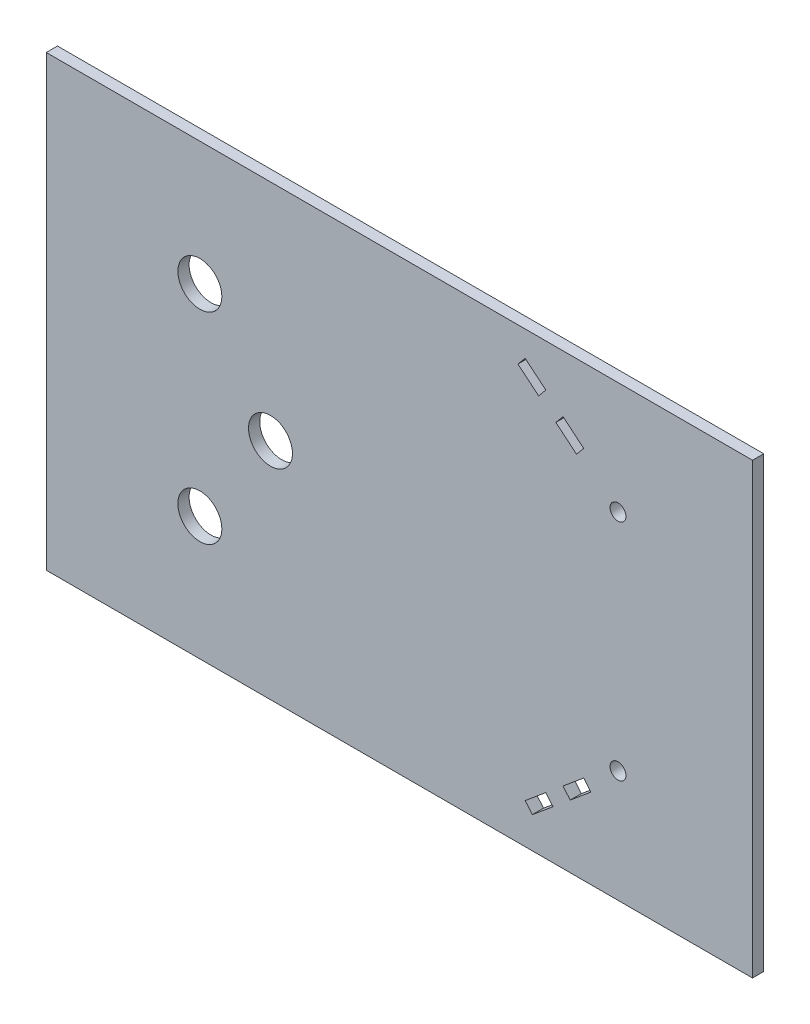
ISO-10303-21;
HEADER;
FILE_DESCRIPTION(('STEP AP214'),'2;1');
FILE_NAME('part.step','',(''),(''),'','','');
FILE_SCHEMA(('AUTOMOTIVE_DESIGN { 1 0 10303 214 1 1 1 1 }'));
ENDSEC;
DATA;
#1=APPLICATION_CONTEXT('core data for automotive mechanical design processes');
#2=APPLICATION_PROTOCOL_DEFINITION('international standard','automotive_design',2000,#1);
#3=PRODUCT_CONTEXT('',#1,'mechanical');
#4=PRODUCT('Part','Part','',(#3));
#5=PRODUCT_RELATED_PRODUCT_CATEGORY('part','',(#4));
#6=PRODUCT_DEFINITION_FORMATION('','',#4);
#7=PRODUCT_DEFINITION_CONTEXT('part definition',#1,'design');
#8=PRODUCT_DEFINITION('design','',#6,#7);
#9=PRODUCT_DEFINITION_SHAPE('','',#8);
#10=(LENGTH_UNIT() NAMED_UNIT(*) SI_UNIT(.MILLI.,.METRE.));
#11=(NAMED_UNIT(*) PLANE_ANGLE_UNIT() SI_UNIT($,.RADIAN.));
#12=(NAMED_UNIT(*) SI_UNIT($,.STERADIAN.) SOLID_ANGLE_UNIT());
#13=UNCERTAINTY_MEASURE_WITH_UNIT(LENGTH_MEASURE(1.E-05),#10,'distance_accuracy_value','');
#14=(GEOMETRIC_REPRESENTATION_CONTEXT(3) GLOBAL_UNCERTAINTY_ASSIGNED_CONTEXT((#13)) GLOBAL_UNIT_ASSIGNED_CONTEXT((#10,
#11,#12)) REPRESENTATION_CONTEXT('',''));
#15=CARTESIAN_POINT('',(0.,0.,0.));
#16=DIRECTION('',(0.,0.,1.));
#17=DIRECTION('',(1.,0.,0.));
#18=AXIS2_PLACEMENT_3D('',#15,#16,#17);
#19=CARTESIAN_POINT('',(0.,0.,6.35));
#20=DIRECTION('',(1.,0.,0.));
#21=DIRECTION('',(0.,0.,-1.));
#22=AXIS2_PLACEMENT_3D('',#19,#20,#21);
#23=PLANE('',#22);
#24=DIRECTION('',(0.,-1.,0.));
#25=VECTOR('',#24,1.);
#26=CARTESIAN_POINT('',(0.,0.,0.));
#27=LINE('',#26,#25);
#28=CARTESIAN_POINT('',(0.,254.,0.));
#29=VERTEX_POINT('',#28);
#30=CARTESIAN_POINT('',(0.,0.,0.));
#31=VERTEX_POINT('',#30);
#32=EDGE_CURVE('E396',#29,#31,#27,.T.);
#33=ORIENTED_EDGE('',*,*,#32,.T.);
#34=DIRECTION('',(0.,0.,-1.));
#35=VECTOR('',#34,1.);
#36=CARTESIAN_POINT('',(0.,0.,6.35));
#37=LINE('',#36,#35);
#38=CARTESIAN_POINT('',(0.,0.,6.35));
#39=VERTEX_POINT('',#38);
#40=EDGE_CURVE('E11',#39,#31,#37,.T.);
#41=ORIENTED_EDGE('',*,*,#40,.F.);
#42=DIRECTION('',(0.,-1.,0.));
#43=VECTOR('',#42,1.);
#44=CARTESIAN_POINT('',(0.,0.,6.35));
#45=LINE('',#44,#43);
#46=CARTESIAN_POINT('',(0.,254.,6.35));
#47=VERTEX_POINT('',#46);
#48=EDGE_CURVE('E400',#47,#39,#45,.T.);
#49=ORIENTED_EDGE('',*,*,#48,.F.);
#50=DIRECTION('',(0.,0.,-1.));
#51=VECTOR('',#50,1.);
#52=CARTESIAN_POINT('',(0.,254.,6.35));
#53=LINE('',#52,#51);
#54=EDGE_CURVE('E414',#47,#29,#53,.T.);
#55=ORIENTED_EDGE('',*,*,#54,.T.);
#56=EDGE_LOOP('',(#33,#41,#49,#55));
#57=FACE_BOUND('',#56,.T.);
#58=ADVANCED_FACE('F39',(#57),#23,.F.);
#59=CARTESIAN_POINT('',(0.,0.,6.35));
#60=DIRECTION('',(0.,1.,0.));
#61=DIRECTION('',(0.,0.,1.));
#62=AXIS2_PLACEMENT_3D('',#59,#60,#61);
#63=PLANE('',#62);
#64=DIRECTION('',(1.,0.,0.));
#65=VECTOR('',#64,1.);
#66=CARTESIAN_POINT('',(0.,0.,0.));
#67=LINE('',#66,#65);
#68=CARTESIAN_POINT('',(400.05,0.,0.));
#69=VERTEX_POINT('',#68);
#70=EDGE_CURVE('E418',#31,#69,#67,.T.);
#71=ORIENTED_EDGE('',*,*,#70,.T.);
#72=DIRECTION('',(0.,0.,-1.));
#73=VECTOR('',#72,1.);
#74=CARTESIAN_POINT('',(400.05,0.,6.35));
#75=LINE('',#74,#73);
#76=CARTESIAN_POINT('',(400.05,0.,6.35));
#77=VERTEX_POINT('',#76);
#78=EDGE_CURVE('E47',#77,#69,#75,.T.);
#79=ORIENTED_EDGE('',*,*,#78,.F.);
#80=DIRECTION('',(1.,0.,0.));
#81=VECTOR('',#80,1.);
#82=CARTESIAN_POINT('',(0.,0.,6.35));
#83=LINE('',#82,#81);
#84=EDGE_CURVE('E404',#39,#77,#83,.T.);
#85=ORIENTED_EDGE('',*,*,#84,.F.);
#86=ORIENTED_EDGE('',*,*,#40,.T.);
#87=EDGE_LOOP('',(#71,#79,#85,#86));
#88=FACE_BOUND('',#87,.T.);
#89=ADVANCED_FACE('F453',(#88),#63,.F.);
#90=CARTESIAN_POINT('',(400.05,0.,6.35));
#91=DIRECTION('',(-1.,0.,0.));
#92=DIRECTION('',(0.,0.,1.));
#93=AXIS2_PLACEMENT_3D('',#90,#91,#92);
#94=PLANE('',#93);
#95=DIRECTION('',(0.,1.,0.));
#96=VECTOR('',#95,1.);
#97=CARTESIAN_POINT('',(400.05,0.,0.));
#98=LINE('',#97,#96);
#99=CARTESIAN_POINT('',(400.05,254.,0.));
#100=VERTEX_POINT('',#99);
#101=EDGE_CURVE('E421',#69,#100,#98,.T.);
#102=ORIENTED_EDGE('',*,*,#101,.T.);
#103=DIRECTION('',(0.,0.,-1.));
#104=VECTOR('',#103,1.);
#105=CARTESIAN_POINT('',(400.05,254.,6.35));
#106=LINE('',#105,#104);
#107=CARTESIAN_POINT('',(400.05,254.,6.35));
#108=VERTEX_POINT('',#107);
#109=EDGE_CURVE('E429',#108,#100,#106,.T.);
#110=ORIENTED_EDGE('',*,*,#109,.F.);
#111=DIRECTION('',(0.,1.,0.));
#112=VECTOR('',#111,1.);
#113=CARTESIAN_POINT('',(400.05,0.,6.35));
#114=LINE('',#113,#112);
#115=EDGE_CURVE('E408',#77,#108,#114,.T.);
#116=ORIENTED_EDGE('',*,*,#115,.F.);
#117=ORIENTED_EDGE('',*,*,#78,.T.);
#118=EDGE_LOOP('',(#102,#110,#116,#117));
#119=FACE_BOUND('',#118,.T.);
#120=ADVANCED_FACE('F438',(#119),#94,.F.);
#121=CARTESIAN_POINT('',(0.,254.,6.35));
#122=DIRECTION('',(0.,-1.,0.));
#123=DIRECTION('',(0.,0.,-1.));
#124=AXIS2_PLACEMENT_3D('',#121,#122,#123);
#125=PLANE('',#124);
#126=DIRECTION('',(-1.,0.,0.));
#127=VECTOR('',#126,1.);
#128=CARTESIAN_POINT('',(0.,254.,0.));
#129=LINE('',#128,#127);
#130=EDGE_CURVE('E405',#100,#29,#129,.T.);
#131=ORIENTED_EDGE('',*,*,#130,.T.);
#132=ORIENTED_EDGE('',*,*,#54,.F.);
#133=DIRECTION('',(-1.,0.,0.));
#134=VECTOR('',#133,1.);
#135=CARTESIAN_POINT('',(0.,254.,6.35));
#136=LINE('',#135,#134);
#137=EDGE_CURVE('E411',#108,#47,#136,.T.);
#138=ORIENTED_EDGE('',*,*,#137,.F.);
#139=ORIENTED_EDGE('',*,*,#109,.T.);
#140=EDGE_LOOP('',(#131,#132,#138,#139));
#141=FACE_BOUND('',#140,.T.);
#142=ADVANCED_FACE('F446',(#141),#125,.F.);
#143=CARTESIAN_POINT('',(0.,0.,6.35));
#144=DIRECTION('',(0.,0.,-1.));
#145=DIRECTION('',(-1.,0.,0.));
#146=AXIS2_PLACEMENT_3D('',#143,#144,#145);
#147=PLANE('',#146);
#148=DIRECTION('',(-0.768221279597376,-0.64018439966448,0.));
#149=VECTOR('',#148,1.);
#150=CARTESIAN_POINT('',(271.25497425998,22.644992790318,6.35));
#151=LINE('',#150,#149);
#152=CARTESIAN_POINT('',(282.962666561044,32.4014030412046,6.35));
#153=VERTEX_POINT('',#152);
#154=CARTESIAN_POINT('',(271.25497425998,22.644992790318,6.35));
#155=VERTEX_POINT('',#154);
#156=EDGE_CURVE('E355',#153,#155,#151,.T.);
#157=ORIENTED_EDGE('',*,*,#156,.F.);
#158=DIRECTION('',(-0.64018439966448,0.768221279597376,0.));
#159=VECTOR('',#158,1.);
#160=CARTESIAN_POINT('',(287.027837498914,27.5231979157613,6.35));
#161=LINE('',#160,#159);
#162=CARTESIAN_POINT('',(287.027837498914,27.5231979157613,6.35));
#163=VERTEX_POINT('',#162);
#164=EDGE_CURVE('E54',#163,#153,#161,.T.);
#165=ORIENTED_EDGE('',*,*,#164,.F.);
#166=DIRECTION('',(0.768221279597376,0.640184399664479,0.));
#167=VECTOR('',#166,1.);
#168=CARTESIAN_POINT('',(275.32014519785,17.7667876648747,6.35));
#169=LINE('',#168,#167);
#170=CARTESIAN_POINT('',(275.32014519785,17.7667876648747,6.35));
#171=VERTEX_POINT('',#170);
#172=EDGE_CURVE('E340',#171,#163,#169,.T.);
#173=ORIENTED_EDGE('',*,*,#172,.F.);
#174=DIRECTION('',(0.64018439966448,-0.768221279597376,0.));
#175=VECTOR('',#174,1.);
#176=CARTESIAN_POINT('',(275.32014519785,17.7667876648747,6.35));
#177=LINE('',#176,#175);
#178=EDGE_CURVE('E359',#155,#171,#177,.T.);
#179=ORIENTED_EDGE('',*,*,#178,.F.);
#180=EDGE_LOOP('',(#157,#165,#173,#179));
#181=FACE_BOUND('',#180,.T.);
#182=DIRECTION('',(0.768221279597375,-0.640184399664481,0.));
#183=VECTOR('',#182,1.);
#184=CARTESIAN_POINT('',(267.189803322111,234.742649657906,6.35));
#185=LINE('',#184,#183);
#186=CARTESIAN_POINT('',(267.189803322111,234.742649657906,6.35));
#187=VERTEX_POINT('',#186);
#188=CARTESIAN_POINT('',(278.897495623175,224.98623940702,6.35));
#189=VERTEX_POINT('',#188);
#190=EDGE_CURVE('E311',#187,#189,#185,.T.);
#191=ORIENTED_EDGE('',*,*,#190,.F.);
#192=DIRECTION('',(-0.64018439966448,-0.768221279597376,0.));
#193=VECTOR('',#192,1.);
#194=CARTESIAN_POINT('',(271.25497425998,239.62085478335,6.35));
#195=LINE('',#194,#193);
#196=CARTESIAN_POINT('',(271.25497425998,239.62085478335,6.35));
#197=VERTEX_POINT('',#196);
#198=EDGE_CURVE('E62',#197,#187,#195,.T.);
#199=ORIENTED_EDGE('',*,*,#198,.F.);
#200=DIRECTION('',(-0.768221279597375,0.640184399664481,0.));
#201=VECTOR('',#200,1.);
#202=CARTESIAN_POINT('',(271.25497425998,239.62085478335,6.35));
#203=LINE('',#202,#201);
#204=CARTESIAN_POINT('',(282.962666561044,229.864444532463,6.35));
#205=VERTEX_POINT('',#204);
#206=EDGE_CURVE('E296',#205,#197,#203,.T.);
#207=ORIENTED_EDGE('',*,*,#206,.F.);
#208=DIRECTION('',(0.64018439966448,0.768221279597376,0.));
#209=VECTOR('',#208,1.);
#210=CARTESIAN_POINT('',(282.962666561044,229.864444532463,6.35));
#211=LINE('',#210,#209);
#212=EDGE_CURVE('E316',#189,#205,#211,.T.);
#213=ORIENTED_EDGE('',*,*,#212,.F.);
#214=EDGE_LOOP('',(#191,#199,#207,#213));
#215=FACE_BOUND('',#214,.T.);
#216=CARTESIAN_POINT('',(127.,127.,6.35));
#217=DIRECTION('',(0.,0.,1.));
#218=DIRECTION('',(1.,0.,0.));
#219=AXIS2_PLACEMENT_3D('',#216,#217,#218);
#220=CIRCLE('',#219,12.446);
#221=CARTESIAN_POINT('',(139.446,127.,6.35));
#222=VERTEX_POINT('',#221);
#223=EDGE_CURVE('E326',#222,#222,#220,.T.);
#224=ORIENTED_EDGE('',*,*,#223,.F.);
#225=EDGE_LOOP('',(#224));
#226=FACE_BOUND('',#225,.T.);
#227=CARTESIAN_POINT('',(323.85,190.5,6.35));
#228=DIRECTION('',(0.,0.,1.));
#229=DIRECTION('',(1.,0.,0.));
#230=AXIS2_PLACEMENT_3D('',#227,#228,#229);
#231=CIRCLE('',#230,4.50000000000002);
#232=CARTESIAN_POINT('',(328.35,190.5,6.35));
#233=VERTEX_POINT('',#232);
#234=EDGE_CURVE('E381',#233,#233,#231,.T.);
#235=ORIENTED_EDGE('',*,*,#234,.F.);
#236=EDGE_LOOP('',(#235));
#237=FACE_BOUND('',#236,.T.);
#238=DIRECTION('',(0.768221279597361,0.640184399664497,0.));
#239=VECTOR('',#238,1.);
#240=CARTESIAN_POINT('',(296.7842477498,35.6535397915001,6.35));
#241=LINE('',#240,#239);
#242=CARTESIAN_POINT('',(296.7842477498,35.6535397915001,6.35));
#243=VERTEX_POINT('',#242);
#244=CARTESIAN_POINT('',(308.491940050864,45.409950042387,6.35));
#245=VERTEX_POINT('',#244);
#246=EDGE_CURVE('E217',#243,#245,#241,.T.);
#247=ORIENTED_EDGE('',*,*,#246,.F.);
#248=DIRECTION('',(0.640184399664498,-0.768221279597361,0.));
#249=VECTOR('',#248,1.);
#250=CARTESIAN_POINT('',(296.7842477498,35.6535397915001,6.35));
#251=LINE('',#250,#249);
#252=CARTESIAN_POINT('',(292.719076811931,40.5317449169434,6.35));
#253=VERTEX_POINT('',#252);
#254=EDGE_CURVE('E183',#253,#243,#251,.T.);
#255=ORIENTED_EDGE('',*,*,#254,.F.);
#256=DIRECTION('',(-0.768221279597362,-0.640184399664497,0.));
#257=VECTOR('',#256,1.);
#258=CARTESIAN_POINT('',(292.719076811931,40.5317449169434,6.35));
#259=LINE('',#258,#257);
#260=CARTESIAN_POINT('',(304.426769112995,50.2881551678303,6.35));
#261=VERTEX_POINT('',#260);
#262=EDGE_CURVE('E204',#261,#253,#259,.T.);
#263=ORIENTED_EDGE('',*,*,#262,.F.);
#264=DIRECTION('',(-0.64018439966449,0.768221279597367,0.));
#265=VECTOR('',#264,1.);
#266=CARTESIAN_POINT('',(308.491940050864,45.409950042387,6.35));
#267=LINE('',#266,#265);
#268=EDGE_CURVE('E208',#245,#261,#267,.T.);
#269=ORIENTED_EDGE('',*,*,#268,.F.);
#270=EDGE_LOOP('',(#247,#255,#263,#269));
#271=FACE_BOUND('',#270,.T.);
#272=CARTESIAN_POINT('',(87.,70.,6.35));
#273=DIRECTION('',(0.,0.,1.));
#274=DIRECTION('',(1.,0.,0.));
#275=AXIS2_PLACEMENT_3D('',#272,#273,#274);
#276=CIRCLE('',#275,12.446);
#277=CARTESIAN_POINT('',(99.446,70.,6.35));
#278=VERTEX_POINT('',#277);
#279=EDGE_CURVE('E235',#278,#278,#276,.T.);
#280=ORIENTED_EDGE('',*,*,#279,.F.);
#281=EDGE_LOOP('',(#280));
#282=FACE_BOUND('',#281,.T.);
#283=CARTESIAN_POINT('',(87.,184.,6.35));
#284=DIRECTION('',(0.,0.,1.));
#285=DIRECTION('',(1.,0.,0.));
#286=AXIS2_PLACEMENT_3D('',#283,#284,#285);
#287=CIRCLE('',#286,12.446);
#288=CARTESIAN_POINT('',(99.446,184.,6.35));
#289=VERTEX_POINT('',#288);
#290=EDGE_CURVE('E243',#289,#289,#287,.T.);
#291=ORIENTED_EDGE('',*,*,#290,.F.);
#292=EDGE_LOOP('',(#291));
#293=FACE_BOUND('',#292,.T.);
#294=DIRECTION('',(0.768221279597378,-0.640184399664477,0.));
#295=VECTOR('',#294,1.);
#296=CARTESIAN_POINT('',(288.653905874061,216.855897531281,6.35));
#297=LINE('',#296,#295);
#298=CARTESIAN_POINT('',(288.653905874061,216.855897531281,6.35));
#299=VERTEX_POINT('',#298);
#300=CARTESIAN_POINT('',(300.361598175125,207.099487280394,6.35));
#301=VERTEX_POINT('',#300);
#302=EDGE_CURVE('E269',#299,#301,#297,.T.);
#303=ORIENTED_EDGE('',*,*,#302,.F.);
#304=DIRECTION('',(-0.640184399664477,-0.768221279597378,0.));
#305=VECTOR('',#304,1.);
#306=CARTESIAN_POINT('',(292.719076811931,221.734102656724,6.35));
#307=LINE('',#306,#305);
#308=CARTESIAN_POINT('',(292.719076811931,221.734102656724,6.35));
#309=VERTEX_POINT('',#308);
#310=EDGE_CURVE('E266',#309,#299,#307,.T.);
#311=ORIENTED_EDGE('',*,*,#310,.F.);
#312=DIRECTION('',(-0.768221279597379,0.640184399664476,0.));
#313=VECTOR('',#312,1.);
#314=CARTESIAN_POINT('',(292.719076811931,221.734102656724,6.35));
#315=LINE('',#314,#313);
#316=CARTESIAN_POINT('',(304.426769112995,211.977692405838,6.35));
#317=VERTEX_POINT('',#316);
#318=EDGE_CURVE('E253',#317,#309,#315,.T.);
#319=ORIENTED_EDGE('',*,*,#318,.F.);
#320=DIRECTION('',(0.640184399664475,0.76822127959738,0.));
#321=VECTOR('',#320,1.);
#322=CARTESIAN_POINT('',(304.426769112995,211.977692405838,6.35));
#323=LINE('',#322,#321);
#324=EDGE_CURVE('E273',#301,#317,#323,.T.);
#325=ORIENTED_EDGE('',*,*,#324,.F.);
#326=EDGE_LOOP('',(#303,#311,#319,#325));
#327=FACE_BOUND('',#326,.T.);
#328=CARTESIAN_POINT('',(323.85,63.5,6.35));
#329=DIRECTION('',(0.,0.,1.));
#330=DIRECTION('',(1.,0.,0.));
#331=AXIS2_PLACEMENT_3D('',#328,#329,#330);
#332=CIRCLE('',#331,4.50000000000002);
#333=CARTESIAN_POINT('',(328.35,63.5,6.35));
#334=VERTEX_POINT('',#333);
#335=EDGE_CURVE('E380',#334,#334,#332,.T.);
#336=ORIENTED_EDGE('',*,*,#335,.F.);
#337=EDGE_LOOP('',(#336));
#338=FACE_BOUND('',#337,.T.);
#339=ORIENTED_EDGE('',*,*,#48,.T.);
#340=ORIENTED_EDGE('',*,*,#84,.T.);
#341=ORIENTED_EDGE('',*,*,#115,.T.);
#342=ORIENTED_EDGE('',*,*,#137,.T.);
#343=EDGE_LOOP('',(#339,#340,#341,#342));
#344=FACE_BOUND('',#343,.T.);
#345=ADVANCED_FACE('F452',(#181,#215,#226,#237,#271,#282,#293,#327,#338,#344),#147,.F.);
#346=CARTESIAN_POINT('',(0.,0.,0.));
#347=DIRECTION('',(0.,0.,-1.));
#348=DIRECTION('',(-1.,0.,0.));
#349=AXIS2_PLACEMENT_3D('',#346,#347,#348);
#350=PLANE('',#349);
#351=DIRECTION('',(-0.64018439966448,0.768221279597376,0.));
#352=VECTOR('',#351,1.);
#353=CARTESIAN_POINT('',(287.027837498914,27.5231979157613,0.));
#354=LINE('',#353,#352);
#355=CARTESIAN_POINT('',(287.027837498914,27.5231979157613,0.));
#356=VERTEX_POINT('',#355);
#357=CARTESIAN_POINT('',(282.962666561044,32.4014030412047,0.));
#358=VERTEX_POINT('',#357);
#359=EDGE_CURVE('E335',#356,#358,#354,.T.);
#360=ORIENTED_EDGE('',*,*,#359,.T.);
#361=DIRECTION('',(-0.768221279597376,-0.64018439966448,0.));
#362=VECTOR('',#361,1.);
#363=CARTESIAN_POINT('',(271.25497425998,22.644992790318,0.));
#364=LINE('',#363,#362);
#365=CARTESIAN_POINT('',(271.25497425998,22.644992790318,0.));
#366=VERTEX_POINT('',#365);
#367=EDGE_CURVE('E339',#358,#366,#364,.T.);
#368=ORIENTED_EDGE('',*,*,#367,.T.);
#369=DIRECTION('',(0.64018439966448,-0.768221279597376,0.));
#370=VECTOR('',#369,1.);
#371=CARTESIAN_POINT('',(275.32014519785,17.7667876648747,0.));
#372=LINE('',#371,#370);
#373=CARTESIAN_POINT('',(275.32014519785,17.7667876648747,0.));
#374=VERTEX_POINT('',#373);
#375=EDGE_CURVE('E344',#366,#374,#372,.T.);
#376=ORIENTED_EDGE('',*,*,#375,.T.);
#377=DIRECTION('',(0.768221279597376,0.640184399664479,0.));
#378=VECTOR('',#377,1.);
#379=CARTESIAN_POINT('',(275.32014519785,17.7667876648747,0.));
#380=LINE('',#379,#378);
#381=EDGE_CURVE('E348',#374,#356,#380,.T.);
#382=ORIENTED_EDGE('',*,*,#381,.T.);
#383=EDGE_LOOP('',(#360,#368,#376,#382));
#384=FACE_BOUND('',#383,.T.);
#385=DIRECTION('',(-0.64018439966448,-0.768221279597376,0.));
#386=VECTOR('',#385,1.);
#387=CARTESIAN_POINT('',(271.25497425998,239.62085478335,0.));
#388=LINE('',#387,#386);
#389=CARTESIAN_POINT('',(271.25497425998,239.62085478335,0.));
#390=VERTEX_POINT('',#389);
#391=CARTESIAN_POINT('',(267.189803322111,234.742649657906,0.));
#392=VERTEX_POINT('',#391);
#393=EDGE_CURVE('E291',#390,#392,#388,.T.);
#394=ORIENTED_EDGE('',*,*,#393,.T.);
#395=DIRECTION('',(0.768221279597375,-0.640184399664481,0.));
#396=VECTOR('',#395,1.);
#397=CARTESIAN_POINT('',(267.189803322111,234.742649657906,0.));
#398=LINE('',#397,#396);
#399=CARTESIAN_POINT('',(278.897495623175,224.98623940702,0.));
#400=VERTEX_POINT('',#399);
#401=EDGE_CURVE('E295',#392,#400,#398,.T.);
#402=ORIENTED_EDGE('',*,*,#401,.T.);
#403=DIRECTION('',(0.64018439966448,0.768221279597376,0.));
#404=VECTOR('',#403,1.);
#405=CARTESIAN_POINT('',(282.962666561044,229.864444532463,0.));
#406=LINE('',#405,#404);
#407=CARTESIAN_POINT('',(282.962666561044,229.864444532463,0.));
#408=VERTEX_POINT('',#407);
#409=EDGE_CURVE('E300',#400,#408,#406,.T.);
#410=ORIENTED_EDGE('',*,*,#409,.T.);
#411=DIRECTION('',(-0.768221279597375,0.640184399664481,0.));
#412=VECTOR('',#411,1.);
#413=CARTESIAN_POINT('',(271.25497425998,239.62085478335,0.));
#414=LINE('',#413,#412);
#415=EDGE_CURVE('E304',#408,#390,#414,.T.);
#416=ORIENTED_EDGE('',*,*,#415,.T.);
#417=EDGE_LOOP('',(#394,#402,#410,#416));
#418=FACE_BOUND('',#417,.T.);
#419=CARTESIAN_POINT('',(127.,127.,0.));
#420=DIRECTION('',(0.,0.,1.));
#421=DIRECTION('',(1.,0.,0.));
#422=AXIS2_PLACEMENT_3D('',#419,#420,#421);
#423=CIRCLE('',#422,12.446);
#424=CARTESIAN_POINT('',(139.446,127.,0.));
#425=VERTEX_POINT('',#424);
#426=EDGE_CURVE('E385',#425,#425,#423,.T.);
#427=ORIENTED_EDGE('',*,*,#426,.T.);
#428=EDGE_LOOP('',(#427));
#429=FACE_BOUND('',#428,.T.);
#430=CARTESIAN_POINT('',(323.85,190.5,0.));
#431=DIRECTION('',(0.,0.,1.));
#432=DIRECTION('',(1.,0.,0.));
#433=AXIS2_PLACEMENT_3D('',#430,#431,#432);
#434=CIRCLE('',#433,4.50000000000002);
#435=CARTESIAN_POINT('',(328.35,190.5,0.));
#436=VERTEX_POINT('',#435);
#437=EDGE_CURVE('E376',#436,#436,#434,.T.);
#438=ORIENTED_EDGE('',*,*,#437,.T.);
#439=EDGE_LOOP('',(#438));
#440=FACE_BOUND('',#439,.T.);
#441=DIRECTION('',(0.640184399664498,-0.768221279597361,0.));
#442=VECTOR('',#441,1.);
#443=CARTESIAN_POINT('',(296.7842477498,35.6535397915001,0.));
#444=LINE('',#443,#442);
#445=CARTESIAN_POINT('',(292.719076811931,40.5317449169434,0.));
#446=VERTEX_POINT('',#445);
#447=CARTESIAN_POINT('',(296.7842477498,35.6535397915001,0.));
#448=VERTEX_POINT('',#447);
#449=EDGE_CURVE('E180',#446,#448,#444,.T.);
#450=ORIENTED_EDGE('',*,*,#449,.T.);
#451=DIRECTION('',(0.768221279597361,0.640184399664497,0.));
#452=VECTOR('',#451,1.);
#453=CARTESIAN_POINT('',(296.7842477498,35.6535397915001,0.));
#454=LINE('',#453,#452);
#455=CARTESIAN_POINT('',(308.491940050864,45.409950042387,0.));
#456=VERTEX_POINT('',#455);
#457=EDGE_CURVE('E193',#448,#456,#454,.T.);
#458=ORIENTED_EDGE('',*,*,#457,.T.);
#459=DIRECTION('',(-0.64018439966449,0.768221279597367,0.));
#460=VECTOR('',#459,1.);
#461=CARTESIAN_POINT('',(308.491940050864,45.409950042387,0.));
#462=LINE('',#461,#460);
#463=CARTESIAN_POINT('',(304.426769112995,50.2881551678303,0.));
#464=VERTEX_POINT('',#463);
#465=EDGE_CURVE('E198',#456,#464,#462,.T.);
#466=ORIENTED_EDGE('',*,*,#465,.T.);
#467=DIRECTION('',(-0.768221279597362,-0.640184399664497,0.));
#468=VECTOR('',#467,1.);
#469=CARTESIAN_POINT('',(292.719076811931,40.5317449169434,0.));
#470=LINE('',#469,#468);
#471=EDGE_CURVE('E189',#464,#446,#470,.T.);
#472=ORIENTED_EDGE('',*,*,#471,.T.);
#473=EDGE_LOOP('',(#450,#458,#466,#472));
#474=FACE_BOUND('',#473,.T.);
#475=CARTESIAN_POINT('',(87.,70.,0.));
#476=DIRECTION('',(0.,0.,1.));
#477=DIRECTION('',(1.,0.,0.));
#478=AXIS2_PLACEMENT_3D('',#475,#476,#477);
#479=CIRCLE('',#478,12.446);
#480=CARTESIAN_POINT('',(99.446,70.,0.));
#481=VERTEX_POINT('',#480);
#482=EDGE_CURVE('E218',#481,#481,#479,.T.);
#483=ORIENTED_EDGE('',*,*,#482,.T.);
#484=EDGE_LOOP('',(#483));
#485=FACE_BOUND('',#484,.T.);
#486=CARTESIAN_POINT('',(87.,184.,0.));
#487=DIRECTION('',(0.,0.,1.));
#488=DIRECTION('',(1.,0.,0.));
#489=AXIS2_PLACEMENT_3D('',#486,#487,#488);
#490=CIRCLE('',#489,12.446);
#491=CARTESIAN_POINT('',(99.446,184.,0.));
#492=VERTEX_POINT('',#491);
#493=EDGE_CURVE('E239',#492,#492,#490,.T.);
#494=ORIENTED_EDGE('',*,*,#493,.T.);
#495=EDGE_LOOP('',(#494));
#496=FACE_BOUND('',#495,.T.);
#497=DIRECTION('',(-0.640184399664477,-0.768221279597378,0.));
#498=VECTOR('',#497,1.);
#499=CARTESIAN_POINT('',(292.719076811931,221.734102656724,0.));
#500=LINE('',#499,#498);
#501=CARTESIAN_POINT('',(292.719076811931,221.734102656724,0.));
#502=VERTEX_POINT('',#501);
#503=CARTESIAN_POINT('',(288.653905874061,216.855897531281,0.));
#504=VERTEX_POINT('',#503);
#505=EDGE_CURVE('E248',#502,#504,#500,.T.);
#506=ORIENTED_EDGE('',*,*,#505,.T.);
#507=DIRECTION('',(0.768221279597378,-0.640184399664477,0.));
#508=VECTOR('',#507,1.);
#509=CARTESIAN_POINT('',(288.653905874061,216.855897531281,0.));
#510=LINE('',#509,#508);
#511=CARTESIAN_POINT('',(300.361598175125,207.099487280394,0.));
#512=VERTEX_POINT('',#511);
#513=EDGE_CURVE('E252',#504,#512,#510,.T.);
#514=ORIENTED_EDGE('',*,*,#513,.T.);
#515=DIRECTION('',(0.640184399664475,0.76822127959738,0.));
#516=VECTOR('',#515,1.);
#517=CARTESIAN_POINT('',(304.426769112995,211.977692405838,0.));
#518=LINE('',#517,#516);
#519=CARTESIAN_POINT('',(304.426769112995,211.977692405838,0.));
#520=VERTEX_POINT('',#519);
#521=EDGE_CURVE('E257',#512,#520,#518,.T.);
#522=ORIENTED_EDGE('',*,*,#521,.T.);
#523=DIRECTION('',(-0.768221279597379,0.640184399664476,0.));
#524=VECTOR('',#523,1.);
#525=CARTESIAN_POINT('',(292.719076811931,221.734102656724,0.));
#526=LINE('',#525,#524);
#527=EDGE_CURVE('E261',#520,#502,#526,.T.);
#528=ORIENTED_EDGE('',*,*,#527,.T.);
#529=EDGE_LOOP('',(#506,#514,#522,#528));
#530=FACE_BOUND('',#529,.T.);
#531=CARTESIAN_POINT('',(323.85,63.5,0.));
#532=DIRECTION('',(0.,0.,1.));
#533=DIRECTION('',(1.,0.,0.));
#534=AXIS2_PLACEMENT_3D('',#531,#532,#533);
#535=CIRCLE('',#534,4.50000000000002);
#536=CARTESIAN_POINT('',(328.35,63.5,0.));
#537=VERTEX_POINT('',#536);
#538=EDGE_CURVE('E392',#537,#537,#535,.T.);
#539=ORIENTED_EDGE('',*,*,#538,.T.);
#540=EDGE_LOOP('',(#539));
#541=FACE_BOUND('',#540,.T.);
#542=ORIENTED_EDGE('',*,*,#32,.F.);
#543=ORIENTED_EDGE('',*,*,#130,.F.);
#544=ORIENTED_EDGE('',*,*,#101,.F.);
#545=ORIENTED_EDGE('',*,*,#70,.F.);
#546=EDGE_LOOP('',(#542,#543,#544,#545));
#547=FACE_BOUND('',#546,.T.);
#548=ADVANCED_FACE('F200',(#384,#418,#429,#440,#474,#485,#496,#530,#541,#547),#350,.T.);
#549=CARTESIAN_POINT('',(323.85,63.5,0.));
#550=DIRECTION('',(0.,0.,1.));
#551=DIRECTION('',(1.,0.,0.));
#552=AXIS2_PLACEMENT_3D('',#549,#550,#551);
#553=CYLINDRICAL_SURFACE('',#552,4.50000000000002);
#554=ORIENTED_EDGE('',*,*,#538,.F.);
#555=EDGE_LOOP('',(#554));
#556=FACE_BOUND('',#555,.T.);
#557=ORIENTED_EDGE('',*,*,#335,.T.);
#558=EDGE_LOOP('',(#557));
#559=FACE_BOUND('',#558,.T.);
#560=ADVANCED_FACE('F465',(#556,#559),#553,.F.);
#561=CARTESIAN_POINT('',(292.719076811931,221.734102656724,0.));
#562=DIRECTION('',(-0.768221279597378,0.640184399664477,0.));
#563=DIRECTION('',(-0.640184399664477,-0.768221279597379,0.));
#564=AXIS2_PLACEMENT_3D('',#561,#562,#563);
#565=PLANE('',#564);
#566=ORIENTED_EDGE('',*,*,#310,.T.);
#567=DIRECTION('',(0.,0.,1.));
#568=VECTOR('',#567,1.);
#569=CARTESIAN_POINT('',(288.653905874061,216.855897531281,0.));
#570=LINE('',#569,#568);
#571=EDGE_CURVE('E265',#504,#299,#570,.T.);
#572=ORIENTED_EDGE('',*,*,#571,.F.);
#573=ORIENTED_EDGE('',*,*,#505,.F.);
#574=DIRECTION('',(0.,0.,1.));
#575=VECTOR('',#574,1.);
#576=CARTESIAN_POINT('',(292.719076811931,221.734102656724,0.));
#577=LINE('',#576,#575);
#578=EDGE_CURVE('E247',#502,#309,#577,.T.);
#579=ORIENTED_EDGE('',*,*,#578,.T.);
#580=EDGE_LOOP('',(#566,#572,#573,#579));
#581=FACE_BOUND('',#580,.T.);
#582=ADVANCED_FACE('F472',(#581),#565,.F.);
#583=CARTESIAN_POINT('',(292.719076811931,221.734102656724,0.));
#584=DIRECTION('',(0.640184399664476,0.768221279597379,0.));
#585=DIRECTION('',(-0.768221279597379,0.640184399664476,0.));
#586=AXIS2_PLACEMENT_3D('',#583,#584,#585);
#587=PLANE('',#586);
#588=ORIENTED_EDGE('',*,*,#318,.T.);
#589=ORIENTED_EDGE('',*,*,#578,.F.);
#590=ORIENTED_EDGE('',*,*,#527,.F.);
#591=DIRECTION('',(0.,0.,1.));
#592=VECTOR('',#591,1.);
#593=CARTESIAN_POINT('',(304.426769112995,211.977692405838,0.));
#594=LINE('',#593,#592);
#595=EDGE_CURVE('E282',#520,#317,#594,.T.);
#596=ORIENTED_EDGE('',*,*,#595,.T.);
#597=EDGE_LOOP('',(#588,#589,#590,#596));
#598=FACE_BOUND('',#597,.T.);
#599=ADVANCED_FACE('F514',(#598),#587,.F.);
#600=CARTESIAN_POINT('',(304.426769112995,211.977692405838,0.));
#601=DIRECTION('',(0.76822127959738,-0.640184399664475,0.));
#602=DIRECTION('',(0.640184399664475,0.76822127959738,0.));
#603=AXIS2_PLACEMENT_3D('',#600,#601,#602);
#604=PLANE('',#603);
#605=ORIENTED_EDGE('',*,*,#324,.T.);
#606=ORIENTED_EDGE('',*,*,#595,.F.);
#607=ORIENTED_EDGE('',*,*,#521,.F.);
#608=DIRECTION('',(0.,0.,1.));
#609=VECTOR('',#608,1.);
#610=CARTESIAN_POINT('',(300.361598175125,207.099487280394,0.));
#611=LINE('',#610,#609);
#612=EDGE_CURVE('E285',#512,#301,#611,.T.);
#613=ORIENTED_EDGE('',*,*,#612,.T.);
#614=EDGE_LOOP('',(#605,#606,#607,#613));
#615=FACE_BOUND('',#614,.T.);
#616=ADVANCED_FACE('F520',(#615),#604,.F.);
#617=CARTESIAN_POINT('',(288.653905874061,216.855897531281,0.));
#618=DIRECTION('',(-0.640184399664477,-0.768221279597378,0.));
#619=DIRECTION('',(0.768221279597378,-0.640184399664477,0.));
#620=AXIS2_PLACEMENT_3D('',#617,#618,#619);
#621=PLANE('',#620);
#622=ORIENTED_EDGE('',*,*,#302,.T.);
#623=ORIENTED_EDGE('',*,*,#612,.F.);
#624=ORIENTED_EDGE('',*,*,#513,.F.);
#625=ORIENTED_EDGE('',*,*,#571,.T.);
#626=EDGE_LOOP('',(#622,#623,#624,#625));
#627=FACE_BOUND('',#626,.T.);
#628=ADVANCED_FACE('F516',(#627),#621,.F.);
#629=CARTESIAN_POINT('',(87.,184.,0.));
#630=DIRECTION('',(0.,0.,1.));
#631=DIRECTION('',(1.,0.,0.));
#632=AXIS2_PLACEMENT_3D('',#629,#630,#631);
#633=CYLINDRICAL_SURFACE('',#632,12.446);
#634=ORIENTED_EDGE('',*,*,#493,.F.);
#635=EDGE_LOOP('',(#634));
#636=FACE_BOUND('',#635,.T.);
#637=ORIENTED_EDGE('',*,*,#290,.T.);
#638=EDGE_LOOP('',(#637));
#639=FACE_BOUND('',#638,.T.);
#640=ADVANCED_FACE('F519',(#636,#639),#633,.F.);
#641=CARTESIAN_POINT('',(87.,70.,0.));
#642=DIRECTION('',(0.,0.,1.));
#643=DIRECTION('',(1.,0.,0.));
#644=AXIS2_PLACEMENT_3D('',#641,#642,#643);
#645=CYLINDRICAL_SURFACE('',#644,12.446);
#646=ORIENTED_EDGE('',*,*,#482,.F.);
#647=EDGE_LOOP('',(#646));
#648=FACE_BOUND('',#647,.T.);
#649=ORIENTED_EDGE('',*,*,#279,.T.);
#650=EDGE_LOOP('',(#649));
#651=FACE_BOUND('',#650,.T.);
#652=ADVANCED_FACE('F530',(#648,#651),#645,.F.);
#653=CARTESIAN_POINT('',(296.7842477498,35.6535397915001,0.));
#654=DIRECTION('',(-0.768221279597361,-0.640184399664498,0.));
#655=DIRECTION('',(0.640184399664498,-0.768221279597361,0.));
#656=AXIS2_PLACEMENT_3D('',#653,#654,#655);
#657=PLANE('',#656);
#658=ORIENTED_EDGE('',*,*,#254,.T.);
#659=DIRECTION('',(0.,0.,1.));
#660=VECTOR('',#659,1.);
#661=CARTESIAN_POINT('',(296.7842477498,35.6535397915001,0.));
#662=LINE('',#661,#660);
#663=EDGE_CURVE('E176',#448,#243,#662,.T.);
#664=ORIENTED_EDGE('',*,*,#663,.F.);
#665=ORIENTED_EDGE('',*,*,#449,.F.);
#666=DIRECTION('',(0.,0.,1.));
#667=VECTOR('',#666,1.);
#668=CARTESIAN_POINT('',(292.719076811931,40.5317449169434,0.));
#669=LINE('',#668,#667);
#670=EDGE_CURVE('E224',#446,#253,#669,.T.);
#671=ORIENTED_EDGE('',*,*,#670,.T.);
#672=EDGE_LOOP('',(#658,#664,#665,#671));
#673=FACE_BOUND('',#672,.T.);
#674=ADVANCED_FACE('F178',(#673),#657,.F.);
#675=CARTESIAN_POINT('',(292.719076811931,40.5317449169434,0.));
#676=DIRECTION('',(-0.640184399664497,0.768221279597362,0.));
#677=DIRECTION('',(-0.768221279597362,-0.640184399664497,0.));
#678=AXIS2_PLACEMENT_3D('',#675,#676,#677);
#679=PLANE('',#678);
#680=ORIENTED_EDGE('',*,*,#262,.T.);
#681=ORIENTED_EDGE('',*,*,#670,.F.);
#682=ORIENTED_EDGE('',*,*,#471,.F.);
#683=DIRECTION('',(0.,0.,1.));
#684=VECTOR('',#683,1.);
#685=CARTESIAN_POINT('',(304.426769112995,50.2881551678303,0.));
#686=LINE('',#685,#684);
#687=EDGE_CURVE('E227',#464,#261,#686,.T.);
#688=ORIENTED_EDGE('',*,*,#687,.T.);
#689=EDGE_LOOP('',(#680,#681,#682,#688));
#690=FACE_BOUND('',#689,.T.);
#691=ADVANCED_FACE('F537',(#690),#679,.F.);
#692=CARTESIAN_POINT('',(308.491940050864,45.409950042387,0.));
#693=DIRECTION('',(0.768221279597367,0.64018439966449,0.));
#694=DIRECTION('',(-0.64018439966449,0.768221279597367,0.));
#695=AXIS2_PLACEMENT_3D('',#692,#693,#694);
#696=PLANE('',#695);
#697=ORIENTED_EDGE('',*,*,#268,.T.);
#698=ORIENTED_EDGE('',*,*,#687,.F.);
#699=ORIENTED_EDGE('',*,*,#465,.F.);
#700=DIRECTION('',(0.,0.,1.));
#701=VECTOR('',#700,1.);
#702=CARTESIAN_POINT('',(308.491940050864,45.409950042387,0.));
#703=LINE('',#702,#701);
#704=EDGE_CURVE('E188',#456,#245,#703,.T.);
#705=ORIENTED_EDGE('',*,*,#704,.T.);
#706=EDGE_LOOP('',(#697,#698,#699,#705));
#707=FACE_BOUND('',#706,.T.);
#708=ADVANCED_FACE('F540',(#707),#696,.F.);
#709=CARTESIAN_POINT('',(296.7842477498,35.6535397915001,0.));
#710=DIRECTION('',(0.640184399664497,-0.768221279597361,0.));
#711=DIRECTION('',(0.768221279597361,0.640184399664498,0.));
#712=AXIS2_PLACEMENT_3D('',#709,#710,#711);
#713=PLANE('',#712);
#714=ORIENTED_EDGE('',*,*,#246,.T.);
#715=ORIENTED_EDGE('',*,*,#704,.F.);
#716=ORIENTED_EDGE('',*,*,#457,.F.);
#717=ORIENTED_EDGE('',*,*,#663,.T.);
#718=EDGE_LOOP('',(#714,#715,#716,#717));
#719=FACE_BOUND('',#718,.T.);
#720=ADVANCED_FACE('F194',(#719),#713,.F.);
#721=CARTESIAN_POINT('',(323.85,190.5,0.));
#722=DIRECTION('',(0.,0.,1.));
#723=DIRECTION('',(1.,0.,0.));
#724=AXIS2_PLACEMENT_3D('',#721,#722,#723);
#725=CYLINDRICAL_SURFACE('',#724,4.50000000000002);
#726=ORIENTED_EDGE('',*,*,#437,.F.);
#727=EDGE_LOOP('',(#726));
#728=FACE_BOUND('',#727,.T.);
#729=ORIENTED_EDGE('',*,*,#234,.T.);
#730=EDGE_LOOP('',(#729));
#731=FACE_BOUND('',#730,.T.);
#732=ADVANCED_FACE('F478',(#728,#731),#725,.F.);
#733=CARTESIAN_POINT('',(127.,127.,0.));
#734=DIRECTION('',(0.,0.,1.));
#735=DIRECTION('',(1.,0.,0.));
#736=AXIS2_PLACEMENT_3D('',#733,#734,#735);
#737=CYLINDRICAL_SURFACE('',#736,12.446);
#738=ORIENTED_EDGE('',*,*,#426,.F.);
#739=EDGE_LOOP('',(#738));
#740=FACE_BOUND('',#739,.T.);
#741=ORIENTED_EDGE('',*,*,#223,.T.);
#742=EDGE_LOOP('',(#741));
#743=FACE_BOUND('',#742,.T.);
#744=ADVANCED_FACE('F474',(#740,#743),#737,.F.);
#745=CARTESIAN_POINT('',(271.25497425998,239.62085478335,0.));
#746=DIRECTION('',(-0.768221279597376,0.64018439966448,0.));
#747=DIRECTION('',(-0.64018439966448,-0.768221279597376,0.));
#748=AXIS2_PLACEMENT_3D('',#745,#746,#747);
#749=PLANE('',#748);
#750=ORIENTED_EDGE('',*,*,#198,.T.);
#751=DIRECTION('',(0.,0.,1.));
#752=VECTOR('',#751,1.);
#753=CARTESIAN_POINT('',(267.189803322111,234.742649657906,0.));
#754=LINE('',#753,#752);
#755=EDGE_CURVE('E308',#392,#187,#754,.T.);
#756=ORIENTED_EDGE('',*,*,#755,.F.);
#757=ORIENTED_EDGE('',*,*,#393,.F.);
#758=DIRECTION('',(0.,0.,1.));
#759=VECTOR('',#758,1.);
#760=CARTESIAN_POINT('',(271.25497425998,239.62085478335,0.));
#761=LINE('',#760,#759);
#762=EDGE_CURVE('E323',#390,#197,#761,.T.);
#763=ORIENTED_EDGE('',*,*,#762,.T.);
#764=EDGE_LOOP('',(#750,#756,#757,#763));
#765=FACE_BOUND('',#764,.T.);
#766=ADVANCED_FACE('F477',(#765),#749,.F.);
#767=CARTESIAN_POINT('',(271.25497425998,239.62085478335,0.));
#768=DIRECTION('',(0.64018439966448,0.768221279597375,0.));
#769=DIRECTION('',(-0.768221279597375,0.64018439966448,0.));
#770=AXIS2_PLACEMENT_3D('',#767,#768,#769);
#771=PLANE('',#770);
#772=ORIENTED_EDGE('',*,*,#206,.T.);
#773=ORIENTED_EDGE('',*,*,#762,.F.);
#774=ORIENTED_EDGE('',*,*,#415,.F.);
#775=DIRECTION('',(0.,0.,1.));
#776=VECTOR('',#775,1.);
#777=CARTESIAN_POINT('',(282.962666561044,229.864444532463,0.));
#778=LINE('',#777,#776);
#779=EDGE_CURVE('E327',#408,#205,#778,.T.);
#780=ORIENTED_EDGE('',*,*,#779,.T.);
#781=EDGE_LOOP('',(#772,#773,#774,#780));
#782=FACE_BOUND('',#781,.T.);
#783=ADVANCED_FACE('F501',(#782),#771,.F.);
#784=CARTESIAN_POINT('',(282.962666561044,229.864444532463,0.));
#785=DIRECTION('',(0.768221279597376,-0.64018439966448,0.));
#786=DIRECTION('',(0.64018439966448,0.768221279597376,0.));
#787=AXIS2_PLACEMENT_3D('',#784,#785,#786);
#788=PLANE('',#787);
#789=ORIENTED_EDGE('',*,*,#212,.T.);
#790=ORIENTED_EDGE('',*,*,#779,.F.);
#791=ORIENTED_EDGE('',*,*,#409,.F.);
#792=DIRECTION('',(0.,0.,1.));
#793=VECTOR('',#792,1.);
#794=CARTESIAN_POINT('',(278.897495623175,224.98623940702,0.));
#795=LINE('',#794,#793);
#796=EDGE_CURVE('E330',#400,#189,#795,.T.);
#797=ORIENTED_EDGE('',*,*,#796,.T.);
#798=EDGE_LOOP('',(#789,#790,#791,#797));
#799=FACE_BOUND('',#798,.T.);
#800=ADVANCED_FACE('F504',(#799),#788,.F.);
#801=CARTESIAN_POINT('',(267.189803322111,234.742649657906,0.));
#802=DIRECTION('',(-0.64018439966448,-0.768221279597375,0.));
#803=DIRECTION('',(0.768221279597375,-0.64018439966448,0.));
#804=AXIS2_PLACEMENT_3D('',#801,#802,#803);
#805=PLANE('',#804);
#806=ORIENTED_EDGE('',*,*,#190,.T.);
#807=ORIENTED_EDGE('',*,*,#796,.F.);
#808=ORIENTED_EDGE('',*,*,#401,.F.);
#809=ORIENTED_EDGE('',*,*,#755,.T.);
#810=EDGE_LOOP('',(#806,#807,#808,#809));
#811=FACE_BOUND('',#810,.T.);
#812=ADVANCED_FACE('F487',(#811),#805,.F.);
#813=CARTESIAN_POINT('',(287.027837498914,27.5231979157613,0.));
#814=DIRECTION('',(0.768221279597376,0.64018439966448,0.));
#815=DIRECTION('',(-0.64018439966448,0.768221279597376,0.));
#816=AXIS2_PLACEMENT_3D('',#813,#814,#815);
#817=PLANE('',#816);
#818=ORIENTED_EDGE('',*,*,#164,.T.);
#819=DIRECTION('',(0.,0.,1.));
#820=VECTOR('',#819,1.);
#821=CARTESIAN_POINT('',(282.962666561044,32.4014030412047,0.));
#822=LINE('',#821,#820);
#823=EDGE_CURVE('E352',#358,#153,#822,.T.);
#824=ORIENTED_EDGE('',*,*,#823,.F.);
#825=ORIENTED_EDGE('',*,*,#359,.F.);
#826=DIRECTION('',(0.,0.,1.));
#827=VECTOR('',#826,1.);
#828=CARTESIAN_POINT('',(287.027837498914,27.5231979157613,0.));
#829=LINE('',#828,#827);
#830=EDGE_CURVE('E312',#356,#163,#829,.T.);
#831=ORIENTED_EDGE('',*,*,#830,.T.);
#832=EDGE_LOOP('',(#818,#824,#825,#831));
#833=FACE_BOUND('',#832,.T.);
#834=ADVANCED_FACE('F483',(#833),#817,.F.);
#835=CARTESIAN_POINT('',(275.32014519785,17.7667876648747,0.));
#836=DIRECTION('',(0.640184399664479,-0.768221279597376,0.));
#837=DIRECTION('',(0.768221279597376,0.640184399664479,0.));
#838=AXIS2_PLACEMENT_3D('',#835,#836,#837);
#839=PLANE('',#838);
#840=ORIENTED_EDGE('',*,*,#172,.T.);
#841=ORIENTED_EDGE('',*,*,#830,.F.);
#842=ORIENTED_EDGE('',*,*,#381,.F.);
#843=DIRECTION('',(0.,0.,1.));
#844=VECTOR('',#843,1.);
#845=CARTESIAN_POINT('',(275.32014519785,17.7667876648747,0.));
#846=LINE('',#845,#844);
#847=EDGE_CURVE('E368',#374,#171,#846,.T.);
#848=ORIENTED_EDGE('',*,*,#847,.T.);
#849=EDGE_LOOP('',(#840,#841,#842,#848));
#850=FACE_BOUND('',#849,.T.);
#851=ADVANCED_FACE('F486',(#850),#839,.F.);
#852=CARTESIAN_POINT('',(275.32014519785,17.7667876648747,0.));
#853=DIRECTION('',(-0.768221279597376,-0.64018439966448,0.));
#854=DIRECTION('',(0.64018439966448,-0.768221279597376,0.));
#855=AXIS2_PLACEMENT_3D('',#852,#853,#854);
#856=PLANE('',#855);
#857=ORIENTED_EDGE('',*,*,#178,.T.);
#858=ORIENTED_EDGE('',*,*,#847,.F.);
#859=ORIENTED_EDGE('',*,*,#375,.F.);
#860=DIRECTION('',(0.,0.,1.));
#861=VECTOR('',#860,1.);
#862=CARTESIAN_POINT('',(271.25497425998,22.644992790318,0.));
#863=LINE('',#862,#861);
#864=EDGE_CURVE('E371',#366,#155,#863,.T.);
#865=ORIENTED_EDGE('',*,*,#864,.T.);
#866=EDGE_LOOP('',(#857,#858,#859,#865));
#867=FACE_BOUND('',#866,.T.);
#868=ADVANCED_FACE('F491',(#867),#856,.F.);
#869=CARTESIAN_POINT('',(271.25497425998,22.644992790318,0.));
#870=DIRECTION('',(-0.64018439966448,0.768221279597376,0.));
#871=DIRECTION('',(-0.768221279597376,-0.64018439966448,0.));
#872=AXIS2_PLACEMENT_3D('',#869,#870,#871);
#873=PLANE('',#872);
#874=ORIENTED_EDGE('',*,*,#156,.T.);
#875=ORIENTED_EDGE('',*,*,#864,.F.);
#876=ORIENTED_EDGE('',*,*,#367,.F.);
#877=ORIENTED_EDGE('',*,*,#823,.T.);
#878=EDGE_LOOP('',(#874,#875,#876,#877));
#879=FACE_BOUND('',#878,.T.);
#880=ADVANCED_FACE('F488',(#879),#873,.F.);
#881=CLOSED_SHELL('',(#58,#89,#120,#142,#345,#548,#560,#582,#599,#616,#628,#640,#652,#674,#691,
#708,#720,#732,#744,#766,#783,#800,#812,#834,#851,#868,#880));
#882=MANIFOLD_SOLID_BREP('B2',#881);
#883=ADVANCED_BREP_SHAPE_REPRESENTATION('',(#18,#882),#14);
#884=SHAPE_DEFINITION_REPRESENTATION(#9,#883);
ENDSEC;
END-ISO-10303-21;
